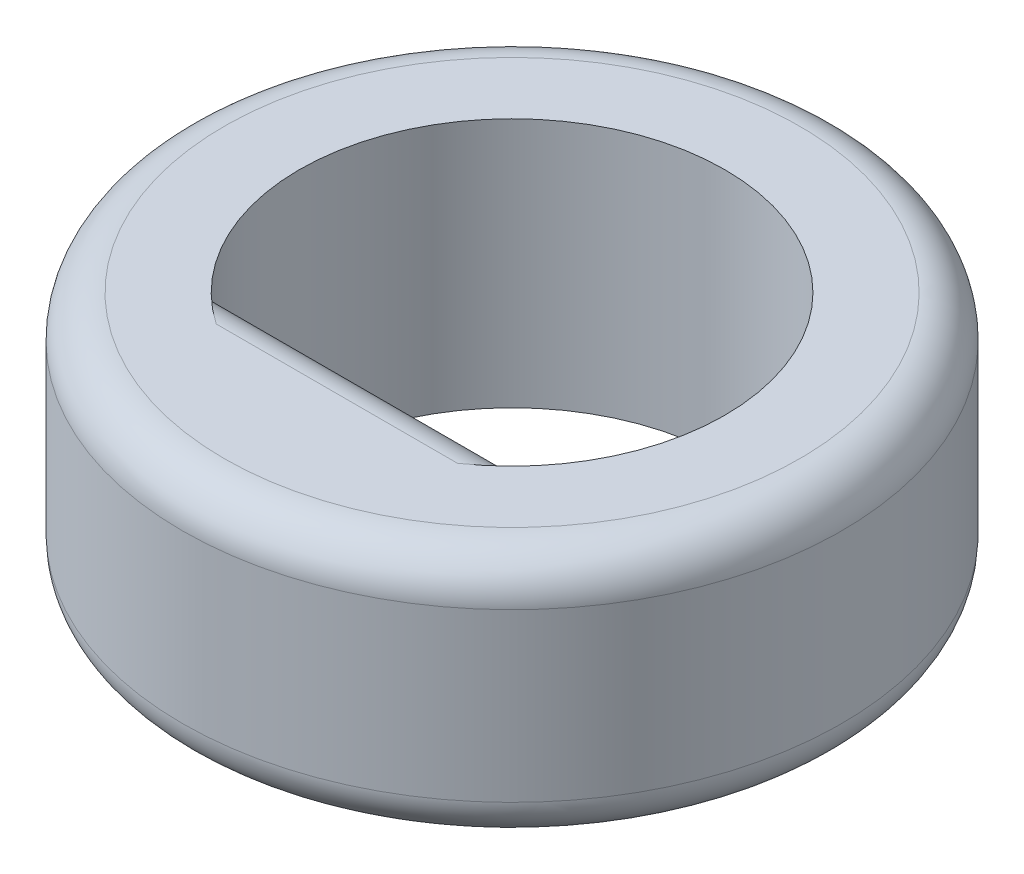
ISO-10303-21;
HEADER;
FILE_DESCRIPTION(('STEP AP214'),'2;1');
FILE_NAME('part.step','',(''),(''),'','','');
FILE_SCHEMA(('AUTOMOTIVE_DESIGN { 1 0 10303 214 1 1 1 1 }'));
ENDSEC;
DATA;
#1=APPLICATION_CONTEXT('core data for automotive mechanical design processes');
#2=APPLICATION_PROTOCOL_DEFINITION('international standard','automotive_design',2000,#1);
#3=PRODUCT_CONTEXT('',#1,'mechanical');
#4=PRODUCT('Part','Part','',(#3));
#5=PRODUCT_RELATED_PRODUCT_CATEGORY('part','',(#4));
#6=PRODUCT_DEFINITION_FORMATION('','',#4);
#7=PRODUCT_DEFINITION_CONTEXT('part definition',#1,'design');
#8=PRODUCT_DEFINITION('design','',#6,#7);
#9=PRODUCT_DEFINITION_SHAPE('','',#8);
#10=(LENGTH_UNIT() NAMED_UNIT(*) SI_UNIT(.MILLI.,.METRE.));
#11=(NAMED_UNIT(*) PLANE_ANGLE_UNIT() SI_UNIT($,.RADIAN.));
#12=(NAMED_UNIT(*) SI_UNIT($,.STERADIAN.) SOLID_ANGLE_UNIT());
#13=UNCERTAINTY_MEASURE_WITH_UNIT(LENGTH_MEASURE(1.E-05),#10,'distance_accuracy_value','');
#14=(GEOMETRIC_REPRESENTATION_CONTEXT(3) GLOBAL_UNCERTAINTY_ASSIGNED_CONTEXT((#13)) GLOBAL_UNIT_ASSIGNED_CONTEXT((#10,
#11,#12)) REPRESENTATION_CONTEXT('',''));
#15=CARTESIAN_POINT('',(0.,0.,0.));
#16=DIRECTION('',(0.,0.,1.));
#17=DIRECTION('',(1.,0.,0.));
#18=AXIS2_PLACEMENT_3D('',#15,#16,#17);
#19=CARTESIAN_POINT('',(0.,3.,0.));
#20=DIRECTION('',(0.,1.,0.));
#21=DIRECTION('',(0.,0.,1.));
#22=AXIS2_PLACEMENT_3D('',#19,#20,#21);
#23=PLANE('',#22);
#24=CARTESIAN_POINT('',(0.,3.,0.));
#25=DIRECTION('',(0.,1.,0.));
#26=DIRECTION('',(0.,0.,1.));
#27=AXIS2_PLACEMENT_3D('',#24,#25,#26);
#28=CIRCLE('',#27,3.45);
#29=CARTESIAN_POINT('',(0.,3.,3.45));
#30=VERTEX_POINT('',#29);
#31=EDGE_CURVE('E106',#30,#30,#28,.T.);
#32=ORIENTED_EDGE('',*,*,#31,.T.);
#33=EDGE_LOOP('',(#32));
#34=FACE_BOUND('',#33,.T.);
#35=CARTESIAN_POINT('',(0.,3.,0.));
#36=DIRECTION('',(0.,1.,0.));
#37=DIRECTION('',(0.,0.,1.));
#38=AXIS2_PLACEMENT_3D('',#35,#36,#37);
#39=CIRCLE('',#38,2.55);
#40=CARTESIAN_POINT('',(1.44654761414894,3.,2.1));
#41=VERTEX_POINT('',#40);
#42=CARTESIAN_POINT('',(-1.44654761414894,3.,2.1));
#43=VERTEX_POINT('',#42);
#44=EDGE_CURVE('E55',#41,#43,#39,.T.);
#45=ORIENTED_EDGE('',*,*,#44,.F.);
#46=DIRECTION('',(1.,0.,0.));
#47=VECTOR('',#46,1.);
#48=CARTESIAN_POINT('',(0.,3.,2.1));
#49=LINE('',#48,#47);
#50=EDGE_CURVE('E109',#41,#43,#49,.F.);
#51=ORIENTED_EDGE('',*,*,#50,.T.);
#52=EDGE_LOOP('',(#45,#51));
#53=FACE_BOUND('',#52,.T.);
#54=ADVANCED_FACE('F35',(#34,#53),#23,.T.);
#55=CARTESIAN_POINT('',(0.,0.,0.));
#56=DIRECTION('',(0.,1.,0.));
#57=DIRECTION('',(0.,0.,1.));
#58=AXIS2_PLACEMENT_3D('',#55,#56,#57);
#59=PLANE('',#58);
#60=CARTESIAN_POINT('',(0.,0.,0.));
#61=DIRECTION('',(0.,1.,0.));
#62=DIRECTION('',(0.,0.,1.));
#63=AXIS2_PLACEMENT_3D('',#60,#61,#62);
#64=CIRCLE('',#63,3.45);
#65=CARTESIAN_POINT('',(0.,0.,3.45));
#66=VERTEX_POINT('',#65);
#67=EDGE_CURVE('E96',#66,#66,#64,.F.);
#68=ORIENTED_EDGE('',*,*,#67,.T.);
#69=EDGE_LOOP('',(#68));
#70=FACE_BOUND('',#69,.T.);
#71=DIRECTION('',(1.,0.,0.));
#72=VECTOR('',#71,1.);
#73=CARTESIAN_POINT('',(1.98557296516648,0.,2.1));
#74=LINE('',#73,#72);
#75=CARTESIAN_POINT('',(-1.44654761414894,0.,2.1));
#76=VERTEX_POINT('',#75);
#77=CARTESIAN_POINT('',(1.44654761414894,0.,2.1));
#78=VERTEX_POINT('',#77);
#79=EDGE_CURVE('E81',#76,#78,#74,.T.);
#80=ORIENTED_EDGE('',*,*,#79,.T.);
#81=CARTESIAN_POINT('',(0.,0.,0.));
#82=DIRECTION('',(0.,1.,0.));
#83=DIRECTION('',(0.,0.,1.));
#84=AXIS2_PLACEMENT_3D('',#81,#82,#83);
#85=CIRCLE('',#84,2.55);
#86=EDGE_CURVE('E77',#78,#76,#85,.T.);
#87=ORIENTED_EDGE('',*,*,#86,.T.);
#88=EDGE_LOOP('',(#80,#87));
#89=FACE_BOUND('',#88,.T.);
#90=ADVANCED_FACE('F79',(#70,#89),#59,.F.);
#91=CARTESIAN_POINT('',(0.,3.,0.));
#92=DIRECTION('',(0.,-1.,0.));
#93=DIRECTION('',(0.,0.,-1.));
#94=AXIS2_PLACEMENT_3D('',#91,#92,#93);
#95=CYLINDRICAL_SURFACE('',#94,3.95);
#96=CARTESIAN_POINT('',(0.,0.5,0.));
#97=DIRECTION('',(0.,1.,0.));
#98=DIRECTION('',(0.,0.,1.));
#99=AXIS2_PLACEMENT_3D('',#96,#97,#98);
#100=CIRCLE('',#99,3.95);
#101=CARTESIAN_POINT('',(0.,0.5,3.95));
#102=VERTEX_POINT('',#101);
#103=EDGE_CURVE('E114',#102,#102,#100,.T.);
#104=ORIENTED_EDGE('',*,*,#103,.T.);
#105=EDGE_LOOP('',(#104));
#106=FACE_BOUND('',#105,.T.);
#107=CARTESIAN_POINT('',(0.,2.5,0.));
#108=DIRECTION('',(0.,1.,0.));
#109=DIRECTION('',(0.,0.,1.));
#110=AXIS2_PLACEMENT_3D('',#107,#108,#109);
#111=CIRCLE('',#110,3.95);
#112=CARTESIAN_POINT('',(0.,2.5,3.95));
#113=VERTEX_POINT('',#112);
#114=EDGE_CURVE('E111',#113,#113,#111,.F.);
#115=ORIENTED_EDGE('',*,*,#114,.T.);
#116=EDGE_LOOP('',(#115));
#117=FACE_BOUND('',#116,.T.);
#118=ADVANCED_FACE('F133',(#106,#117),#95,.T.);
#119=CARTESIAN_POINT('',(0.,3.,0.));
#120=DIRECTION('',(0.,-1.,0.));
#121=DIRECTION('',(0.,0.,-1.));
#122=AXIS2_PLACEMENT_3D('',#119,#120,#121);
#123=CYLINDRICAL_SURFACE('',#122,2.55);
#124=ORIENTED_EDGE('',*,*,#86,.F.);
#125=CARTESIAN_POINT('',(1.44654761414894,0.,2.1));
#126=CARTESIAN_POINT('',(1.47221680494123,8.11878801705917E-06,2.08232475286997));
#127=CARTESIAN_POINT('',(1.49757756264594,0.000938890549439439,2.0641552540516));
#128=CARTESIAN_POINT('',(1.54761149435729,0.00501207609553632,2.02691105723259));
#129=CARTESIAN_POINT('',(1.57228115062918,0.00816420642932072,2.00783272698602));
#130=CARTESIAN_POINT('',(1.62097911310797,0.0171163573537794,1.96873477680558));
#131=CARTESIAN_POINT('',(1.64499318058948,0.0229536413293507,1.94870559109005));
#132=CARTESIAN_POINT('',(1.69168889411883,0.0377060434328964,1.90830785721338));
#133=CARTESIAN_POINT('',(1.71437313837858,0.0466149086982748,1.88794007789338));
#134=CARTESIAN_POINT('',(1.75901601311423,0.0684015807866967,1.84643660567148));
#135=CARTESIAN_POINT('',(1.78090664967415,0.0814272780321462,1.82530370549162));
#136=CARTESIAN_POINT('',(1.8223305779507,0.111718458571836,1.78394573409194));
#137=CARTESIAN_POINT('',(1.84187399859094,0.128964671331563,1.76371701749334));
#138=CARTESIAN_POINT('',(1.87527202576508,0.164985662527647,1.72810792646161));
#139=CARTESIAN_POINT('',(1.8895389573223,0.183110858766853,1.71246170609599));
#140=CARTESIAN_POINT('',(1.91558128778337,0.22260960405015,1.6832797330926));
#141=CARTESIAN_POINT('',(1.92735721967961,0.243982456516959,1.66974352914378));
#142=CARTESIAN_POINT('',(1.94640439677075,0.286207208495194,1.64748063062344));
#143=CARTESIAN_POINT('',(1.95408693829241,0.306652986962298,1.63833665065711));
#144=CARTESIAN_POINT('',(1.96706515267343,0.349243518065675,1.62273162194924));
#145=CARTESIAN_POINT('',(1.9723642366828,0.371385789223604,1.61626673999349));
#146=CARTESIAN_POINT('',(1.97941572781858,0.41128527106163,1.60761861446663));
#147=CARTESIAN_POINT('',(1.98171614018965,0.428806636146442,1.60477777093613));
#148=CARTESIAN_POINT('',(1.98479854775699,0.464213621072161,1.60096102285889));
#149=CARTESIAN_POINT('',(1.98557781780626,0.482099836751248,1.59998846542129));
#150=CARTESIAN_POINT('',(1.98557296516648,0.5,1.6));
#151=B_SPLINE_CURVE_WITH_KNOTS('',3,(#125,#126,#127,#128,#129,#130,#131,#132,#133,#134,#135,
#136,#137,#138,#139,#140,#141,#142,#143,#144,#145,#146,#147,#148,#149,#150),.UNSPECIFIED.,.F.,
.F.,(4,2,2,2,2,2,2,2,2,2,2,2,4),(0.,0.0935189391469967,0.187449503550304,0.282724859089298,
0.377807395328916,0.476792415430492,0.575333644960909,0.658625161403454,0.741898838120599,
0.81263385587501,0.88326731463239,0.936804238904699,0.99043698759062),.UNSPECIFIED.);
#152=CARTESIAN_POINT('',(1.98557296516648,0.5,1.6));
#153=VERTEX_POINT('',#152);
#154=EDGE_CURVE('E92',#78,#153,#151,.T.);
#155=ORIENTED_EDGE('',*,*,#154,.T.);
#156=DIRECTION('',(0.,-1.,0.));
#157=VECTOR('',#156,1.);
#158=CARTESIAN_POINT('',(1.98557296516648,3.,1.6));
#159=LINE('',#158,#157);
#160=CARTESIAN_POINT('',(1.98557296516648,2.5,1.6));
#161=VERTEX_POINT('',#160);
#162=EDGE_CURVE('E224',#161,#153,#159,.T.);
#163=ORIENTED_EDGE('',*,*,#162,.F.);
#164=CARTESIAN_POINT('',(1.98557296516648,2.5,1.6));
#165=CARTESIAN_POINT('',(1.98559003328864,2.52329721487099,1.59996372671844));
#166=CARTESIAN_POINT('',(1.98426289274526,2.54656385738201,1.60162587292458));
#167=CARTESIAN_POINT('',(1.97906213878483,2.59224951490531,1.60805550721849));
#168=CARTESIAN_POINT('',(1.9752020734833,2.614672372193,1.6128064725832));
#169=CARTESIAN_POINT('',(1.96508032528755,2.65812157533071,1.62512104783632));
#170=CARTESIAN_POINT('',(1.95882126021475,2.67914941420563,1.63268159160136));
#171=CARTESIAN_POINT('',(1.94411404229955,2.71938993815114,1.65016717518194));
#172=CARTESIAN_POINT('',(1.93566345497358,2.7386005719569,1.66009484355683));
#173=CARTESIAN_POINT('',(1.91632410917995,2.77585623690674,1.68238810376968));
#174=CARTESIAN_POINT('',(1.90532949809318,2.79378476396907,1.69485534850781));
#175=CARTESIAN_POINT('',(1.88150917228117,2.8271233405884,1.72126128941569));
#176=CARTESIAN_POINT('',(1.86868403056949,2.84253417503682,1.73519952476473));
#177=CARTESIAN_POINT('',(1.8344649679437,2.87816839084199,1.7714780277832));
#178=CARTESIAN_POINT('',(1.81205971428458,2.89678279916858,1.79444852188095));
#179=CARTESIAN_POINT('',(1.76442609208697,2.92882792301025,1.8413112835499));
#180=CARTESIAN_POINT('',(1.73918099931331,2.94222560920223,1.86520840367788));
#181=CARTESIAN_POINT('',(1.69245011629172,2.96194697097438,1.90758463651918));
#182=CARTESIAN_POINT('',(1.67136329649921,2.96917914188999,1.92609620676483));
#183=CARTESIAN_POINT('',(1.6281552474853,2.98118264349987,1.96275675765156));
#184=CARTESIAN_POINT('',(1.60603269318856,2.98595072241323,1.9809052289343));
#185=CARTESIAN_POINT('',(1.56134047447905,2.99327310971445,2.01631223425802));
#186=CARTESIAN_POINT('',(1.53878391894212,2.99586213562637,2.03358043786007));
#187=CARTESIAN_POINT('',(1.49308582318712,2.99922002455088,2.06736650726347));
#188=CARTESIAN_POINT('',(1.46994625062336,2.9999943490198,2.0838864773587));
#189=CARTESIAN_POINT('',(1.44654761414894,3.,2.1));
#190=B_SPLINE_CURVE_WITH_KNOTS('',3,(#164,#165,#166,#167,#168,#169,#170,#171,#172,#173,#174,
#175,#176,#177,#178,#179,#180,#181,#182,#183,#184,#185,#186,#187,#188,#189),.UNSPECIFIED.,.F.,
.F.,(4,2,2,2,2,2,2,2,2,2,2,2,4),(0.,0.0697465905994526,0.139123128489239,0.20842417629577,
0.277802540399295,0.350874498432342,0.423923632610795,0.534593705711382,0.645953507534077,
0.732751317121664,0.81966338028074,0.905163003205239,0.990404977430048),.UNSPECIFIED.);
#191=EDGE_CURVE('E49',#161,#41,#190,.T.);
#192=ORIENTED_EDGE('',*,*,#191,.T.);
#193=ORIENTED_EDGE('',*,*,#44,.T.);
#194=CARTESIAN_POINT('',(-1.44654761414894,3.,2.1));
#195=CARTESIAN_POINT('',(-1.47221680494123,2.99999188121198,2.08232475286997));
#196=CARTESIAN_POINT('',(-1.49757756264594,2.99906110945056,2.0641552540516));
#197=CARTESIAN_POINT('',(-1.54761149435729,2.99498792390446,2.02691105723259));
#198=CARTESIAN_POINT('',(-1.57228115062918,2.99183579357068,2.00783272698602));
#199=CARTESIAN_POINT('',(-1.62097911310797,2.98288364264622,1.96873477680558));
#200=CARTESIAN_POINT('',(-1.64499318058948,2.97704635867065,1.94870559109005));
#201=CARTESIAN_POINT('',(-1.69168889411883,2.9622939565671,1.90830785721338));
#202=CARTESIAN_POINT('',(-1.71437313837858,2.95338509130173,1.88794007789338));
#203=CARTESIAN_POINT('',(-1.75901601311423,2.9315984192133,1.84643660567148));
#204=CARTESIAN_POINT('',(-1.78090664967415,2.91857272196785,1.82530370549162));
#205=CARTESIAN_POINT('',(-1.8223305779507,2.88828154142816,1.78394573409194));
#206=CARTESIAN_POINT('',(-1.84187399859094,2.87103532866844,1.76371701749334));
#207=CARTESIAN_POINT('',(-1.87527202576508,2.83501433747235,1.72810792646161));
#208=CARTESIAN_POINT('',(-1.8895389573223,2.81688914123315,1.71246170609599));
#209=CARTESIAN_POINT('',(-1.91558128778337,2.77739039594985,1.6832797330926));
#210=CARTESIAN_POINT('',(-1.92735721967961,2.75601754348304,1.66974352914378));
#211=CARTESIAN_POINT('',(-1.94640439677075,2.71379279150481,1.64748063062344));
#212=CARTESIAN_POINT('',(-1.95408693829241,2.6933470130377,1.63833665065711));
#213=CARTESIAN_POINT('',(-1.96706515267343,2.65075648193433,1.62273162194924));
#214=CARTESIAN_POINT('',(-1.9723642366828,2.6286142107764,1.61626673999349));
#215=CARTESIAN_POINT('',(-1.97941572781858,2.58871472893837,1.60761861446663));
#216=CARTESIAN_POINT('',(-1.98171614018965,2.57119336385356,1.60477777093613));
#217=CARTESIAN_POINT('',(-1.98479854775699,2.53578637892784,1.60096102285889));
#218=CARTESIAN_POINT('',(-1.98557781780626,2.51790016324875,1.59998846542129));
#219=CARTESIAN_POINT('',(-1.98557296516648,2.5,1.6));
#220=B_SPLINE_CURVE_WITH_KNOTS('',3,(#194,#195,#196,#197,#198,#199,#200,#201,#202,#203,#204,
#205,#206,#207,#208,#209,#210,#211,#212,#213,#214,#215,#216,#217,#218,#219),.UNSPECIFIED.,.F.,
.F.,(4,2,2,2,2,2,2,2,2,2,2,2,4),(0.,0.0935189391469969,0.187449503550304,0.282724859089298,
0.377807395328917,0.476792415430492,0.575333644960909,0.658625161403454,0.741898838120599,
0.81263385587501,0.88326731463239,0.936804238904699,0.99043698759062),.UNSPECIFIED.);
#221=CARTESIAN_POINT('',(-1.98557296516648,2.5,1.6));
#222=VERTEX_POINT('',#221);
#223=EDGE_CURVE('E11',#43,#222,#220,.T.);
#224=ORIENTED_EDGE('',*,*,#223,.T.);
#225=DIRECTION('',(0.,-1.,0.));
#226=VECTOR('',#225,1.);
#227=CARTESIAN_POINT('',(-1.98557296516648,3.,1.6));
#228=LINE('',#227,#226);
#229=CARTESIAN_POINT('',(-1.98557296516648,0.5,1.6));
#230=VERTEX_POINT('',#229);
#231=EDGE_CURVE('E89',#222,#230,#228,.T.);
#232=ORIENTED_EDGE('',*,*,#231,.T.);
#233=CARTESIAN_POINT('',(-1.98557296516648,0.5,1.6));
#234=CARTESIAN_POINT('',(-1.98559003328864,0.476702785129007,1.59996372671844));
#235=CARTESIAN_POINT('',(-1.98426289274526,0.453436142617992,1.60162587292458));
#236=CARTESIAN_POINT('',(-1.97906213878483,0.407750485094692,1.60805550721849));
#237=CARTESIAN_POINT('',(-1.9752020734833,0.385327627807,1.6128064725832));
#238=CARTESIAN_POINT('',(-1.96508032528755,0.341878424669288,1.62512104783632));
#239=CARTESIAN_POINT('',(-1.95882126021475,0.320850585794373,1.63268159160136));
#240=CARTESIAN_POINT('',(-1.94411404229955,0.280610061848864,1.65016717518194));
#241=CARTESIAN_POINT('',(-1.93566345497358,0.261399428043102,1.66009484355683));
#242=CARTESIAN_POINT('',(-1.91632410917995,0.224143763093259,1.68238810376968));
#243=CARTESIAN_POINT('',(-1.90532949809318,0.206215236030926,1.69485534850781));
#244=CARTESIAN_POINT('',(-1.88150917228117,0.172876659411595,1.72126128941569));
#245=CARTESIAN_POINT('',(-1.86868403056949,0.157465824963185,1.73519952476473));
#246=CARTESIAN_POINT('',(-1.8344649679437,0.121831609158005,1.7714780277832));
#247=CARTESIAN_POINT('',(-1.81205971428458,0.10321720083142,1.79444852188095));
#248=CARTESIAN_POINT('',(-1.76442609208697,0.071172076989749,1.8413112835499));
#249=CARTESIAN_POINT('',(-1.73918099931331,0.0577743907977661,1.86520840367788));
#250=CARTESIAN_POINT('',(-1.69245011629172,0.0380530290256249,1.90758463651918));
#251=CARTESIAN_POINT('',(-1.67136329649921,0.0308208581100086,1.92609620676483));
#252=CARTESIAN_POINT('',(-1.62815524748531,0.018817356500129,1.96275675765156));
#253=CARTESIAN_POINT('',(-1.60603269318856,0.0140492775867728,1.9809052289343));
#254=CARTESIAN_POINT('',(-1.56134047447905,0.00672689028554686,2.01631223425802));
#255=CARTESIAN_POINT('',(-1.53878391894212,0.00413786437363218,2.03358043786007));
#256=CARTESIAN_POINT('',(-1.49308582318712,0.000779975449120726,2.06736650726347));
#257=CARTESIAN_POINT('',(-1.46994625062336,5.65098020494935E-06,2.0838864773587));
#258=CARTESIAN_POINT('',(-1.44654761414894,0.,2.1));
#259=B_SPLINE_CURVE_WITH_KNOTS('',3,(#233,#234,#235,#236,#237,#238,#239,#240,#241,#242,#243,
#244,#245,#246,#247,#248,#249,#250,#251,#252,#253,#254,#255,#256,#257,#258),.UNSPECIFIED.,.F.,
.F.,(4,2,2,2,2,2,2,2,2,2,2,2,4),(0.,0.0697465905994525,0.139123128489239,0.20842417629577,
0.277802540399295,0.350874498432341,0.423923632610795,0.534593705711382,0.645953507534076,
0.732751317121663,0.81966338028074,0.905163003205238,0.990404977430047),.UNSPECIFIED.);
#260=EDGE_CURVE('E86',#230,#76,#259,.T.);
#261=ORIENTED_EDGE('',*,*,#260,.T.);
#262=EDGE_LOOP('',(#124,#155,#163,#192,#193,#224,#232,#261));
#263=FACE_BOUND('',#262,.T.);
#264=ADVANCED_FACE('F87',(#263),#123,.F.);
#265=CARTESIAN_POINT('',(-1.98557296516648,3.,1.6));
#266=DIRECTION('',(0.,0.,-1.));
#267=DIRECTION('',(-1.,0.,0.));
#268=AXIS2_PLACEMENT_3D('',#265,#266,#267);
#269=PLANE('',#268);
#270=ORIENTED_EDGE('',*,*,#162,.T.);
#271=DIRECTION('',(1.,0.,0.));
#272=VECTOR('',#271,1.);
#273=CARTESIAN_POINT('',(-1.98557296516648,0.5,1.6));
#274=LINE('',#273,#272);
#275=EDGE_CURVE('E99',#153,#230,#274,.F.);
#276=ORIENTED_EDGE('',*,*,#275,.T.);
#277=ORIENTED_EDGE('',*,*,#231,.F.);
#278=DIRECTION('',(1.,0.,0.));
#279=VECTOR('',#278,1.);
#280=CARTESIAN_POINT('',(-1.98557296516648,2.5,1.6));
#281=LINE('',#280,#279);
#282=EDGE_CURVE('E95',#222,#161,#281,.T.);
#283=ORIENTED_EDGE('',*,*,#282,.T.);
#284=EDGE_LOOP('',(#270,#276,#277,#283));
#285=FACE_BOUND('',#284,.T.);
#286=ADVANCED_FACE('F132',(#285),#269,.T.);
#287=CARTESIAN_POINT('',(0.,0.5,2.1));
#288=DIRECTION('',(-1.,0.,0.));
#289=DIRECTION('',(0.,0.,1.));
#290=AXIS2_PLACEMENT_3D('',#287,#288,#289);
#291=CYLINDRICAL_SURFACE('',#290,0.5);
#292=ORIENTED_EDGE('',*,*,#260,.F.);
#293=ORIENTED_EDGE('',*,*,#275,.F.);
#294=ORIENTED_EDGE('',*,*,#154,.F.);
#295=ORIENTED_EDGE('',*,*,#79,.F.);
#296=EDGE_LOOP('',(#292,#293,#294,#295));
#297=FACE_BOUND('',#296,.T.);
#298=ADVANCED_FACE('F94',(#297),#291,.T.);
#299=CARTESIAN_POINT('',(-1.98557296516648,2.5,2.1));
#300=DIRECTION('',(1.,0.,0.));
#301=DIRECTION('',(0.,0.,-1.));
#302=AXIS2_PLACEMENT_3D('',#299,#300,#301);
#303=CYLINDRICAL_SURFACE('',#302,0.5);
#304=ORIENTED_EDGE('',*,*,#223,.F.);
#305=ORIENTED_EDGE('',*,*,#50,.F.);
#306=ORIENTED_EDGE('',*,*,#191,.F.);
#307=ORIENTED_EDGE('',*,*,#282,.F.);
#308=EDGE_LOOP('',(#304,#305,#306,#307));
#309=FACE_BOUND('',#308,.T.);
#310=ADVANCED_FACE('F142',(#309),#303,.T.);
#311=CARTESIAN_POINT('',(0.,0.5,0.));
#312=DIRECTION('',(0.,1.,0.));
#313=DIRECTION('',(0.,0.,1.));
#314=AXIS2_PLACEMENT_3D('',#311,#312,#313);
#315=TOROIDAL_SURFACE('',#314,3.45,0.5);
#316=ORIENTED_EDGE('',*,*,#67,.F.);
#317=EDGE_LOOP('',(#316));
#318=FACE_BOUND('',#317,.T.);
#319=ORIENTED_EDGE('',*,*,#103,.F.);
#320=EDGE_LOOP('',(#319));
#321=FACE_BOUND('',#320,.T.);
#322=ADVANCED_FACE('F145',(#318,#321),#315,.T.);
#323=CARTESIAN_POINT('',(0.,2.5,0.));
#324=DIRECTION('',(0.,1.,0.));
#325=DIRECTION('',(0.,0.,1.));
#326=AXIS2_PLACEMENT_3D('',#323,#324,#325);
#327=TOROIDAL_SURFACE('',#326,3.45,0.5);
#328=ORIENTED_EDGE('',*,*,#114,.F.);
#329=EDGE_LOOP('',(#328));
#330=FACE_BOUND('',#329,.T.);
#331=ORIENTED_EDGE('',*,*,#31,.F.);
#332=EDGE_LOOP('',(#331));
#333=FACE_BOUND('',#332,.T.);
#334=ADVANCED_FACE('F37',(#330,#333),#327,.T.);
#335=CLOSED_SHELL('',(#54,#90,#118,#264,#286,#298,#310,#322,#334));
#336=MANIFOLD_SOLID_BREP('B2',#335);
#337=ADVANCED_BREP_SHAPE_REPRESENTATION('',(#18,#336),#14);
#338=SHAPE_DEFINITION_REPRESENTATION(#9,#337);
ENDSEC;
END-ISO-10303-21;
